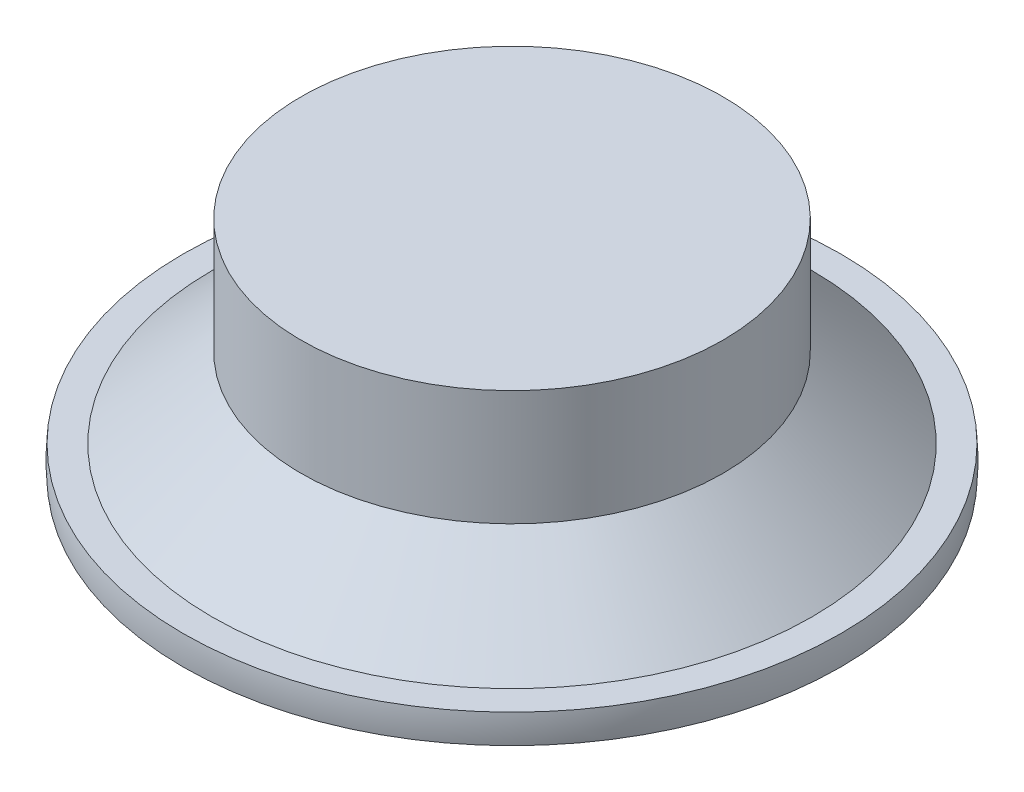
ISO-10303-21;
HEADER;
FILE_DESCRIPTION(('STEP AP214'),'2;1');
FILE_NAME('part.step','',(''),(''),'','','');
FILE_SCHEMA(('AUTOMOTIVE_DESIGN { 1 0 10303 214 1 1 1 1 }'));
ENDSEC;
DATA;
#1=APPLICATION_CONTEXT('core data for automotive mechanical design processes');
#2=APPLICATION_PROTOCOL_DEFINITION('international standard','automotive_design',2000,#1);
#3=PRODUCT_CONTEXT('',#1,'mechanical');
#4=PRODUCT('Part','Part','',(#3));
#5=PRODUCT_RELATED_PRODUCT_CATEGORY('part','',(#4));
#6=PRODUCT_DEFINITION_FORMATION('','',#4);
#7=PRODUCT_DEFINITION_CONTEXT('part definition',#1,'design');
#8=PRODUCT_DEFINITION('design','',#6,#7);
#9=PRODUCT_DEFINITION_SHAPE('','',#8);
#10=(LENGTH_UNIT() NAMED_UNIT(*) SI_UNIT(.MILLI.,.METRE.));
#11=(NAMED_UNIT(*) PLANE_ANGLE_UNIT() SI_UNIT($,.RADIAN.));
#12=(NAMED_UNIT(*) SI_UNIT($,.STERADIAN.) SOLID_ANGLE_UNIT());
#13=UNCERTAINTY_MEASURE_WITH_UNIT(LENGTH_MEASURE(1.E-05),#10,'distance_accuracy_value','');
#14=(GEOMETRIC_REPRESENTATION_CONTEXT(3) GLOBAL_UNCERTAINTY_ASSIGNED_CONTEXT((#13)) GLOBAL_UNIT_ASSIGNED_CONTEXT((#10,
#11,#12)) REPRESENTATION_CONTEXT('',''));
#15=CARTESIAN_POINT('',(0.,0.,0.));
#16=DIRECTION('',(0.,0.,1.));
#17=DIRECTION('',(1.,0.,0.));
#18=AXIS2_PLACEMENT_3D('',#15,#16,#17);
#19=CARTESIAN_POINT('',(0.,0.,0.));
#20=DIRECTION('',(0.,1.,0.));
#21=DIRECTION('',(-1.,0.,0.));
#22=AXIS2_PLACEMENT_3D('',#19,#20,#21);
#23=PLANE('',#22);
#24=CARTESIAN_POINT('',(0.,0.,0.));
#25=DIRECTION('',(0.,-1.,0.));
#26=DIRECTION('',(1.,0.,0.));
#27=AXIS2_PLACEMENT_3D('',#24,#25,#26);
#28=CIRCLE('',#27,39.9054300810129);
#29=CARTESIAN_POINT('',(39.9054300810129,0.,0.));
#30=VERTEX_POINT('',#29);
#31=EDGE_CURVE('E10',#30,#30,#28,.T.);
#32=ORIENTED_EDGE('',*,*,#31,.T.);
#33=EDGE_LOOP('',(#32));
#34=FACE_BOUND('',#33,.T.);
#35=ADVANCED_FACE('F32',(#34),#23,.F.);
#36=CARTESIAN_POINT('',(0.,1.76,0.));
#37=DIRECTION('',(0.,-1.,0.));
#38=DIRECTION('',(1.,0.,0.));
#39=AXIS2_PLACEMENT_3D('',#36,#37,#38);
#40=TOROIDAL_SURFACE('',#39,23.5754143450212,16.4245856549788);
#41=CARTESIAN_POINT('',(0.,3.52,0.));
#42=DIRECTION('',(0.,-1.,0.));
#43=DIRECTION('',(1.,0.,0.));
#44=AXIS2_PLACEMENT_3D('',#41,#42,#43);
#45=CIRCLE('',#44,39.9054300810129);
#46=CARTESIAN_POINT('',(39.9054300810129,3.52,0.));
#47=VERTEX_POINT('',#46);
#48=EDGE_CURVE('E38',#47,#47,#45,.T.);
#49=ORIENTED_EDGE('',*,*,#48,.T.);
#50=EDGE_LOOP('',(#49));
#51=FACE_BOUND('',#50,.T.);
#52=ORIENTED_EDGE('',*,*,#31,.F.);
#53=EDGE_LOOP('',(#52));
#54=FACE_BOUND('',#53,.T.);
#55=ADVANCED_FACE('F67',(#51,#54),#40,.T.);
#56=CARTESIAN_POINT('',(0.,3.52,0.));
#57=DIRECTION('',(0.,1.,0.));
#58=DIRECTION('',(-1.,0.,0.));
#59=AXIS2_PLACEMENT_3D('',#56,#57,#58);
#60=PLANE('',#59);
#61=CARTESIAN_POINT('',(0.,3.52,0.));
#62=DIRECTION('',(0.,-1.,0.));
#63=DIRECTION('',(1.,0.,0.));
#64=AXIS2_PLACEMENT_3D('',#61,#62,#63);
#65=CIRCLE('',#64,36.4054300810129);
#66=CARTESIAN_POINT('',(36.4054300810129,3.52,0.));
#67=VERTEX_POINT('',#66);
#68=EDGE_CURVE('E42',#67,#67,#65,.T.);
#69=ORIENTED_EDGE('',*,*,#68,.T.);
#70=EDGE_LOOP('',(#69));
#71=FACE_BOUND('',#70,.T.);
#72=ORIENTED_EDGE('',*,*,#48,.F.);
#73=EDGE_LOOP('',(#72));
#74=FACE_BOUND('',#73,.T.);
#75=ADVANCED_FACE('F71',(#71,#74),#60,.T.);
#76=CARTESIAN_POINT('',(0.,3.52,0.));
#77=DIRECTION('',(0.,-1.,0.));
#78=DIRECTION('',(1.,0.,0.));
#79=AXIS2_PLACEMENT_3D('',#76,#77,#78);
#80=CONICAL_SURFACE('',#79,36.4054300810129,0.840281066410935);
#81=CARTESIAN_POINT('',(0.,13.2,0.));
#82=DIRECTION('',(0.,-1.,0.));
#83=DIRECTION('',(1.,0.,0.));
#84=AXIS2_PLACEMENT_3D('',#81,#82,#83);
#85=CIRCLE('',#84,25.6);
#86=CARTESIAN_POINT('',(25.6,13.2,0.));
#87=VERTEX_POINT('',#86);
#88=EDGE_CURVE('E46',#87,#87,#85,.T.);
#89=ORIENTED_EDGE('',*,*,#88,.T.);
#90=EDGE_LOOP('',(#89));
#91=FACE_BOUND('',#90,.T.);
#92=ORIENTED_EDGE('',*,*,#68,.F.);
#93=EDGE_LOOP('',(#92));
#94=FACE_BOUND('',#93,.T.);
#95=ADVANCED_FACE('F63',(#91,#94),#80,.T.);
#96=CARTESIAN_POINT('',(0.,0.,0.));
#97=DIRECTION('',(0.,-1.,0.));
#98=DIRECTION('',(1.,0.,0.));
#99=AXIS2_PLACEMENT_3D('',#96,#97,#98);
#100=CYLINDRICAL_SURFACE('',#99,25.6);
#101=ORIENTED_EDGE('',*,*,#88,.F.);
#102=EDGE_LOOP('',(#101));
#103=FACE_BOUND('',#102,.T.);
#104=CARTESIAN_POINT('',(0.,27.2,0.));
#105=DIRECTION('',(0.,-1.,0.));
#106=DIRECTION('',(1.,0.,0.));
#107=AXIS2_PLACEMENT_3D('',#104,#105,#106);
#108=CIRCLE('',#107,25.6);
#109=CARTESIAN_POINT('',(25.6,27.2,0.));
#110=VERTEX_POINT('',#109);
#111=EDGE_CURVE('E51',#110,#110,#108,.T.);
#112=ORIENTED_EDGE('',*,*,#111,.T.);
#113=EDGE_LOOP('',(#112));
#114=FACE_BOUND('',#113,.T.);
#115=ADVANCED_FACE('F55',(#103,#114),#100,.T.);
#116=CARTESIAN_POINT('',(0.,27.2,0.));
#117=DIRECTION('',(0.,-1.,0.));
#118=DIRECTION('',(1.,0.,0.));
#119=AXIS2_PLACEMENT_3D('',#116,#117,#118);
#120=PLANE('',#119);
#121=ORIENTED_EDGE('',*,*,#111,.F.);
#122=EDGE_LOOP('',(#121));
#123=FACE_BOUND('',#122,.T.);
#124=ADVANCED_FACE('F57',(#123),#120,.F.);
#125=CLOSED_SHELL('',(#35,#55,#75,#95,#115,#124));
#126=MANIFOLD_SOLID_BREP('B2',#125);
#127=ADVANCED_BREP_SHAPE_REPRESENTATION('',(#18,#126),#14);
#128=SHAPE_DEFINITION_REPRESENTATION(#9,#127);
ENDSEC;
END-ISO-10303-21;
